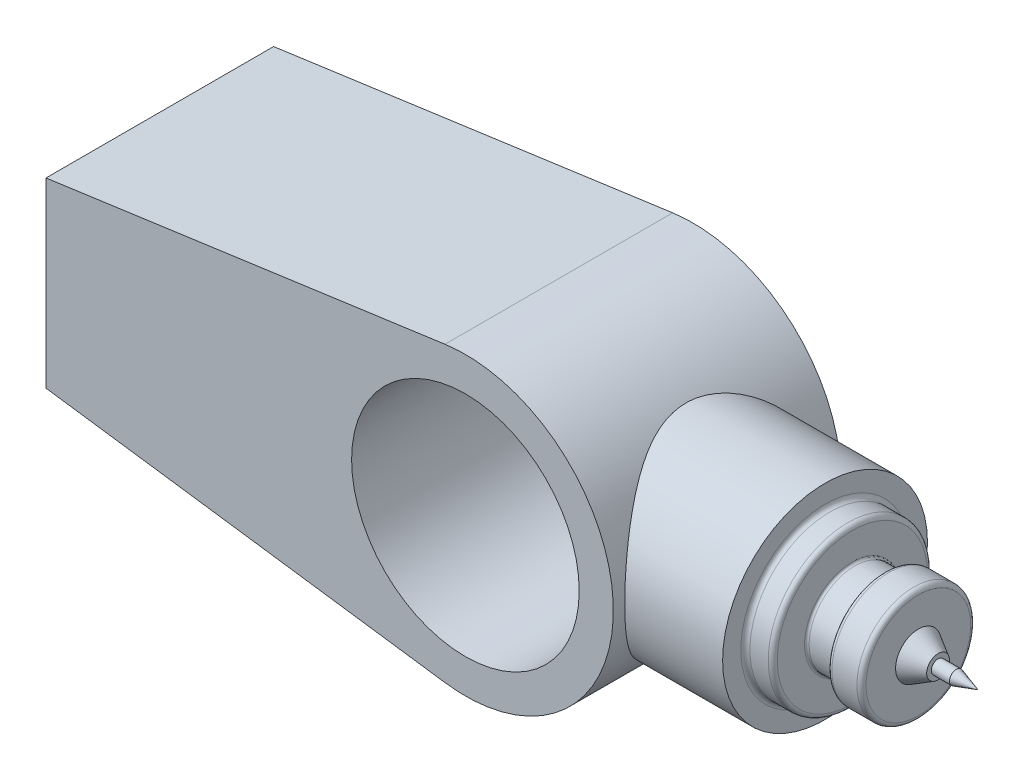
ISO-10303-21;
HEADER;
FILE_DESCRIPTION(('STEP AP214'),'2;1');
FILE_NAME('part.step','',(''),(''),'','','');
FILE_SCHEMA(('AUTOMOTIVE_DESIGN { 1 0 10303 214 1 1 1 1 }'));
ENDSEC;
DATA;
#1=APPLICATION_CONTEXT('core data for automotive mechanical design processes');
#2=APPLICATION_PROTOCOL_DEFINITION('international standard','automotive_design',2000,#1);
#3=PRODUCT_CONTEXT('',#1,'mechanical');
#4=PRODUCT('Part','Part','',(#3));
#5=PRODUCT_RELATED_PRODUCT_CATEGORY('part','',(#4));
#6=PRODUCT_DEFINITION_FORMATION('','',#4);
#7=PRODUCT_DEFINITION_CONTEXT('part definition',#1,'design');
#8=PRODUCT_DEFINITION('design','',#6,#7);
#9=PRODUCT_DEFINITION_SHAPE('','',#8);
#10=(LENGTH_UNIT() NAMED_UNIT(*) SI_UNIT(.MILLI.,.METRE.));
#11=(NAMED_UNIT(*) PLANE_ANGLE_UNIT() SI_UNIT($,.RADIAN.));
#12=(NAMED_UNIT(*) SI_UNIT($,.STERADIAN.) SOLID_ANGLE_UNIT());
#13=UNCERTAINTY_MEASURE_WITH_UNIT(LENGTH_MEASURE(1.E-05),#10,'distance_accuracy_value','');
#14=(GEOMETRIC_REPRESENTATION_CONTEXT(3) GLOBAL_UNCERTAINTY_ASSIGNED_CONTEXT((#13)) GLOBAL_UNIT_ASSIGNED_CONTEXT((#10,
#11,#12)) REPRESENTATION_CONTEXT('',''));
#15=CARTESIAN_POINT('',(0.,0.,0.));
#16=DIRECTION('',(0.,0.,1.));
#17=DIRECTION('',(1.,0.,0.));
#18=AXIS2_PLACEMENT_3D('',#15,#16,#17);
#19=CARTESIAN_POINT('',(120.,0.,0.));
#20=DIRECTION('',(1.,0.,0.));
#21=DIRECTION('',(0.,0.,-1.));
#22=AXIS2_PLACEMENT_3D('',#19,#20,#21);
#23=PLANE('',#22);
#24=CARTESIAN_POINT('',(120.,0.,0.));
#25=DIRECTION('',(1.,0.,0.));
#26=DIRECTION('',(0.,0.,-1.));
#27=AXIS2_PLACEMENT_3D('',#24,#25,#26);
#28=CIRCLE('',#27,21.);
#29=CARTESIAN_POINT('',(120.,0.,-21.));
#30=VERTEX_POINT('',#29);
#31=EDGE_CURVE('E160',#30,#30,#28,.F.);
#32=ORIENTED_EDGE('',*,*,#31,.T.);
#33=EDGE_LOOP('',(#32));
#34=FACE_BOUND('',#33,.T.);
#35=CARTESIAN_POINT('',(120.,0.,0.));
#36=DIRECTION('',(1.,0.,0.));
#37=DIRECTION('',(0.,0.,-1.));
#38=AXIS2_PLACEMENT_3D('',#35,#36,#37);
#39=CIRCLE('',#38,33.);
#40=CARTESIAN_POINT('',(120.,0.,-33.));
#41=VERTEX_POINT('',#40);
#42=EDGE_CURVE('E163',#41,#41,#39,.T.);
#43=ORIENTED_EDGE('',*,*,#42,.T.);
#44=EDGE_LOOP('',(#43));
#45=FACE_BOUND('',#44,.T.);
#46=ADVANCED_FACE('F45',(#34,#45),#23,.T.);
#47=CARTESIAN_POINT('',(0.,0.,0.));
#48=DIRECTION('',(-1.,0.,0.));
#49=DIRECTION('',(0.,0.,1.));
#50=AXIS2_PLACEMENT_3D('',#47,#48,#49);
#51=CYLINDRICAL_SURFACE('',#50,20.);
#52=CARTESIAN_POINT('',(121.,0.,0.));
#53=DIRECTION('',(1.,0.,0.));
#54=DIRECTION('',(0.,0.,-1.));
#55=AXIS2_PLACEMENT_3D('',#52,#53,#54);
#56=CIRCLE('',#55,20.);
#57=CARTESIAN_POINT('',(121.,0.,-20.));
#58=VERTEX_POINT('',#57);
#59=EDGE_CURVE('E55',#58,#58,#56,.T.);
#60=ORIENTED_EDGE('',*,*,#59,.T.);
#61=EDGE_LOOP('',(#60));
#62=FACE_BOUND('',#61,.T.);
#63=CARTESIAN_POINT('',(133.,0.,0.));
#64=DIRECTION('',(-1.,0.,0.));
#65=DIRECTION('',(0.,0.,1.));
#66=AXIS2_PLACEMENT_3D('',#63,#64,#65);
#67=CIRCLE('',#66,20.);
#68=CARTESIAN_POINT('',(133.,0.,20.));
#69=VERTEX_POINT('',#68);
#70=EDGE_CURVE('E190',#69,#69,#67,.T.);
#71=ORIENTED_EDGE('',*,*,#70,.T.);
#72=EDGE_LOOP('',(#71));
#73=FACE_BOUND('',#72,.T.);
#74=ADVANCED_FACE('F148',(#62,#73),#51,.T.);
#75=CARTESIAN_POINT('',(134.,-20.,0.));
#76=DIRECTION('',(-1.,0.,0.));
#77=DIRECTION('',(0.,0.,1.));
#78=AXIS2_PLACEMENT_3D('',#75,#76,#77);
#79=PLANE('',#78);
#80=CARTESIAN_POINT('',(134.,0.,0.));
#81=DIRECTION('',(-1.,0.,0.));
#82=DIRECTION('',(0.,0.,1.));
#83=AXIS2_PLACEMENT_3D('',#80,#81,#82);
#84=CIRCLE('',#83,21.);
#85=CARTESIAN_POINT('',(134.,0.,21.));
#86=VERTEX_POINT('',#85);
#87=EDGE_CURVE('E11',#86,#86,#84,.F.);
#88=ORIENTED_EDGE('',*,*,#87,.T.);
#89=EDGE_LOOP('',(#88));
#90=FACE_BOUND('',#89,.T.);
#91=CARTESIAN_POINT('',(134.,0.,0.));
#92=DIRECTION('',(-1.,0.,0.));
#93=DIRECTION('',(0.,0.,1.));
#94=AXIS2_PLACEMENT_3D('',#91,#92,#93);
#95=CIRCLE('',#94,23.);
#96=CARTESIAN_POINT('',(134.,0.,23.));
#97=VERTEX_POINT('',#96);
#98=EDGE_CURVE('E167',#97,#97,#95,.T.);
#99=ORIENTED_EDGE('',*,*,#98,.T.);
#100=EDGE_LOOP('',(#99));
#101=FACE_BOUND('',#100,.T.);
#102=ADVANCED_FACE('F155',(#90,#101),#79,.T.);
#103=CARTESIAN_POINT('',(0.,0.,0.));
#104=DIRECTION('',(-1.,0.,0.));
#105=DIRECTION('',(0.,0.,1.));
#106=AXIS2_PLACEMENT_3D('',#103,#104,#105);
#107=CYLINDRICAL_SURFACE('',#106,25.);
#108=CARTESIAN_POINT('',(147.,0.,0.));
#109=DIRECTION('',(1.,0.,0.));
#110=DIRECTION('',(0.,0.,-1.));
#111=AXIS2_PLACEMENT_3D('',#108,#109,#110);
#112=CIRCLE('',#111,25.);
#113=CARTESIAN_POINT('',(147.,0.,-25.));
#114=VERTEX_POINT('',#113);
#115=EDGE_CURVE('E293',#114,#114,#112,.F.);
#116=ORIENTED_EDGE('',*,*,#115,.T.);
#117=EDGE_LOOP('',(#116));
#118=FACE_BOUND('',#117,.T.);
#119=CARTESIAN_POINT('',(136.,0.,0.));
#120=DIRECTION('',(-1.,0.,0.));
#121=DIRECTION('',(0.,0.,1.));
#122=AXIS2_PLACEMENT_3D('',#119,#120,#121);
#123=CIRCLE('',#122,25.);
#124=CARTESIAN_POINT('',(136.,0.,25.));
#125=VERTEX_POINT('',#124);
#126=EDGE_CURVE('E289',#125,#125,#123,.F.);
#127=ORIENTED_EDGE('',*,*,#126,.T.);
#128=EDGE_LOOP('',(#127));
#129=FACE_BOUND('',#128,.T.);
#130=ADVANCED_FACE('F305',(#118,#129),#107,.T.);
#131=CARTESIAN_POINT('',(149.,-25.,0.));
#132=DIRECTION('',(1.,0.,0.));
#133=DIRECTION('',(0.,0.,-1.));
#134=AXIS2_PLACEMENT_3D('',#131,#132,#133);
#135=PLANE('',#134);
#136=CARTESIAN_POINT('',(149.,0.,0.));
#137=DIRECTION('',(1.,0.,0.));
#138=DIRECTION('',(0.,0.,-1.));
#139=AXIS2_PLACEMENT_3D('',#136,#137,#138);
#140=CIRCLE('',#139,23.);
#141=CARTESIAN_POINT('',(149.,0.,-23.));
#142=VERTEX_POINT('',#141);
#143=EDGE_CURVE('E177',#142,#142,#140,.T.);
#144=ORIENTED_EDGE('',*,*,#143,.T.);
#145=EDGE_LOOP('',(#144));
#146=FACE_BOUND('',#145,.T.);
#147=CARTESIAN_POINT('',(149.,0.,0.));
#148=DIRECTION('',(-1.,0.,0.));
#149=DIRECTION('',(0.,0.,1.));
#150=AXIS2_PLACEMENT_3D('',#147,#148,#149);
#151=CIRCLE('',#150,10.);
#152=CARTESIAN_POINT('',(149.,0.,10.));
#153=VERTEX_POINT('',#152);
#154=EDGE_CURVE('E126',#153,#153,#151,.T.);
#155=ORIENTED_EDGE('',*,*,#154,.T.);
#156=EDGE_LOOP('',(#155));
#157=FACE_BOUND('',#156,.T.);
#158=ADVANCED_FACE('F300',(#146,#157),#135,.T.);
#159=CARTESIAN_POINT('',(149.,0.,0.));
#160=DIRECTION('',(-1.,0.,0.));
#161=DIRECTION('',(0.,0.,1.));
#162=AXIS2_PLACEMENT_3D('',#159,#160,#161);
#163=CONICAL_SURFACE('',#162,10.,0.523598775598294);
#164=CARTESIAN_POINT('',(157.660254037844,0.,0.));
#165=DIRECTION('',(-1.,0.,0.));
#166=DIRECTION('',(0.,0.,1.));
#167=AXIS2_PLACEMENT_3D('',#164,#165,#166);
#168=CIRCLE('',#167,5.00000000000002);
#169=CARTESIAN_POINT('',(157.660254037844,0.,5.00000000000002));
#170=VERTEX_POINT('',#169);
#171=EDGE_CURVE('E117',#170,#170,#168,.T.);
#172=ORIENTED_EDGE('',*,*,#171,.T.);
#173=EDGE_LOOP('',(#172));
#174=FACE_BOUND('',#173,.T.);
#175=ORIENTED_EDGE('',*,*,#154,.F.);
#176=EDGE_LOOP('',(#175));
#177=FACE_BOUND('',#176,.T.);
#178=ADVANCED_FACE('F320',(#174,#177),#163,.T.);
#179=CARTESIAN_POINT('',(157.660254037844,-5.00000000000002,0.));
#180=DIRECTION('',(1.,0.,0.));
#181=DIRECTION('',(0.,0.,-1.));
#182=AXIS2_PLACEMENT_3D('',#179,#180,#181);
#183=PLANE('',#182);
#184=CARTESIAN_POINT('',(157.660254037844,0.,0.));
#185=DIRECTION('',(-1.,0.,0.));
#186=DIRECTION('',(0.,0.,1.));
#187=AXIS2_PLACEMENT_3D('',#184,#185,#186);
#188=CIRCLE('',#187,3.00000000000002);
#189=CARTESIAN_POINT('',(157.660254037844,0.,3.00000000000002));
#190=VERTEX_POINT('',#189);
#191=EDGE_CURVE('E110',#190,#190,#188,.T.);
#192=ORIENTED_EDGE('',*,*,#191,.T.);
#193=EDGE_LOOP('',(#192));
#194=FACE_BOUND('',#193,.T.);
#195=ORIENTED_EDGE('',*,*,#171,.F.);
#196=EDGE_LOOP('',(#195));
#197=FACE_BOUND('',#196,.T.);
#198=ADVANCED_FACE('F323',(#194,#197),#183,.T.);
#199=CARTESIAN_POINT('',(0.,0.,0.));
#200=DIRECTION('',(-1.,0.,0.));
#201=DIRECTION('',(0.,0.,1.));
#202=AXIS2_PLACEMENT_3D('',#199,#200,#201);
#203=CYLINDRICAL_SURFACE('',#202,3.00000000000002);
#204=CARTESIAN_POINT('',(165.660254037844,0.,0.));
#205=DIRECTION('',(-1.,0.,0.));
#206=DIRECTION('',(0.,0.,1.));
#207=AXIS2_PLACEMENT_3D('',#204,#205,#206);
#208=CIRCLE('',#207,3.00000000000002);
#209=CARTESIAN_POINT('',(165.660254037844,0.,3.00000000000002));
#210=VERTEX_POINT('',#209);
#211=EDGE_CURVE('E107',#210,#210,#208,.T.);
#212=ORIENTED_EDGE('',*,*,#211,.T.);
#213=EDGE_LOOP('',(#212));
#214=FACE_BOUND('',#213,.T.);
#215=ORIENTED_EDGE('',*,*,#191,.F.);
#216=EDGE_LOOP('',(#215));
#217=FACE_BOUND('',#216,.T.);
#218=ADVANCED_FACE('F103',(#214,#217),#203,.T.);
#219=CARTESIAN_POINT('',(165.660254037844,0.,0.));
#220=DIRECTION('',(-1.,0.,0.));
#221=DIRECTION('',(0.,0.,1.));
#222=AXIS2_PLACEMENT_3D('',#219,#220,#221);
#223=CONICAL_SURFACE('',#222,3.00000000000002,0.304692654015402);
#224=CARTESIAN_POINT('',(175.199646052014,0.,0.));
#225=VERTEX_POINT('',#224);
#226=VERTEX_LOOP('',#225);
#227=FACE_BOUND('',#226,.T.);
#228=ORIENTED_EDGE('',*,*,#211,.F.);
#229=EDGE_LOOP('',(#228));
#230=FACE_BOUND('',#229,.T.);
#231=ADVANCED_FACE('F99',(#227,#230),#223,.T.);
#232=CARTESIAN_POINT('',(108.,0.,0.));
#233=DIRECTION('',(1.,0.,0.));
#234=DIRECTION('',(0.,0.,-1.));
#235=AXIS2_PLACEMENT_3D('',#232,#233,#234);
#236=PLANE('',#235);
#237=CARTESIAN_POINT('',(108.,0.,0.));
#238=DIRECTION('',(1.,0.,0.));
#239=DIRECTION('',(0.,0.,-1.));
#240=AXIS2_PLACEMENT_3D('',#237,#238,#239);
#241=CIRCLE('',#240,37.);
#242=CARTESIAN_POINT('',(108.,0.,-37.));
#243=VERTEX_POINT('',#242);
#244=EDGE_CURVE('E184',#243,#243,#241,.F.);
#245=ORIENTED_EDGE('',*,*,#244,.T.);
#246=EDGE_LOOP('',(#245));
#247=FACE_BOUND('',#246,.T.);
#248=CARTESIAN_POINT('',(108.,0.,0.));
#249=DIRECTION('',(1.,0.,0.));
#250=DIRECTION('',(0.,0.,-1.));
#251=AXIS2_PLACEMENT_3D('',#248,#249,#250);
#252=CIRCLE('',#251,45.);
#253=CARTESIAN_POINT('',(108.,0.,-45.));
#254=VERTEX_POINT('',#253);
#255=EDGE_CURVE('E111',#254,#254,#252,.T.);
#256=ORIENTED_EDGE('',*,*,#255,.T.);
#257=EDGE_LOOP('',(#256));
#258=FACE_BOUND('',#257,.T.);
#259=ADVANCED_FACE('F102',(#247,#258),#236,.T.);
#260=CARTESIAN_POINT('',(108.,0.,0.));
#261=DIRECTION('',(1.,0.,0.));
#262=DIRECTION('',(0.,0.,-1.));
#263=AXIS2_PLACEMENT_3D('',#260,#261,#262);
#264=CYLINDRICAL_SURFACE('',#263,35.);
#265=CARTESIAN_POINT('',(118.,0.,0.));
#266=DIRECTION('',(1.,0.,0.));
#267=DIRECTION('',(0.,0.,-1.));
#268=AXIS2_PLACEMENT_3D('',#265,#266,#267);
#269=CIRCLE('',#268,35.);
#270=CARTESIAN_POINT('',(118.,0.,-35.));
#271=VERTEX_POINT('',#270);
#272=EDGE_CURVE('E173',#271,#271,#269,.F.);
#273=ORIENTED_EDGE('',*,*,#272,.T.);
#274=EDGE_LOOP('',(#273));
#275=FACE_BOUND('',#274,.T.);
#276=CARTESIAN_POINT('',(110.,0.,0.));
#277=DIRECTION('',(1.,0.,0.));
#278=DIRECTION('',(0.,0.,-1.));
#279=AXIS2_PLACEMENT_3D('',#276,#277,#278);
#280=CIRCLE('',#279,35.);
#281=CARTESIAN_POINT('',(110.,0.,-35.));
#282=VERTEX_POINT('',#281);
#283=EDGE_CURVE('E166',#282,#282,#280,.T.);
#284=ORIENTED_EDGE('',*,*,#283,.T.);
#285=EDGE_LOOP('',(#284));
#286=FACE_BOUND('',#285,.T.);
#287=ADVANCED_FACE('F245',(#275,#286),#264,.T.);
#288=CARTESIAN_POINT('',(0.,0.,50.));
#289=DIRECTION('',(0.,0.,-1.));
#290=DIRECTION('',(-1.,0.,0.));
#291=AXIS2_PLACEMENT_3D('',#288,#289,#290);
#292=CYLINDRICAL_SURFACE('',#291,50.);
#293=CARTESIAN_POINT('',(0.,0.,50.));
#294=DIRECTION('',(0.,0.,1.));
#295=DIRECTION('',(1.,0.,0.));
#296=AXIS2_PLACEMENT_3D('',#293,#294,#295);
#297=CIRCLE('',#296,50.);
#298=CARTESIAN_POINT('',(50.,0.,50.));
#299=VERTEX_POINT('',#298);
#300=EDGE_CURVE('E140',#299,#299,#297,.T.);
#301=ORIENTED_EDGE('',*,*,#300,.T.);
#302=EDGE_LOOP('',(#301));
#303=FACE_BOUND('',#302,.T.);
#304=CARTESIAN_POINT('',(0.,0.,-50.));
#305=DIRECTION('',(0.,0.,1.));
#306=DIRECTION('',(1.,0.,0.));
#307=AXIS2_PLACEMENT_3D('',#304,#305,#306);
#308=CIRCLE('',#307,50.);
#309=CARTESIAN_POINT('',(50.,0.,-50.));
#310=VERTEX_POINT('',#309);
#311=EDGE_CURVE('E139',#310,#310,#308,.T.);
#312=ORIENTED_EDGE('',*,*,#311,.F.);
#313=EDGE_LOOP('',(#312));
#314=FACE_BOUND('',#313,.T.);
#315=ADVANCED_FACE('F233',(#303,#314),#292,.F.);
#316=CARTESIAN_POINT('',(-184.256419232424,40.,50.));
#317=DIRECTION('',(1.,0.,0.));
#318=DIRECTION('',(0.,1.,0.));
#319=AXIS2_PLACEMENT_3D('',#316,#317,#318);
#320=PLANE('',#319);
#321=DIRECTION('',(0.,-1.,0.));
#322=VECTOR('',#321,1.);
#323=CARTESIAN_POINT('',(-184.256419232424,40.,-50.));
#324=LINE('',#323,#322);
#325=CARTESIAN_POINT('',(-184.256419232424,40.,-50.));
#326=VERTEX_POINT('',#325);
#327=CARTESIAN_POINT('',(-184.256419232423,-40.,-50.));
#328=VERTEX_POINT('',#327);
#329=EDGE_CURVE('E274',#326,#328,#324,.T.);
#330=ORIENTED_EDGE('',*,*,#329,.T.);
#331=DIRECTION('',(0.,0.,-1.));
#332=VECTOR('',#331,1.);
#333=CARTESIAN_POINT('',(-184.256419232423,-40.,50.));
#334=LINE('',#333,#332);
#335=CARTESIAN_POINT('',(-184.256419232423,-40.,50.));
#336=VERTEX_POINT('',#335);
#337=EDGE_CURVE('E283',#336,#328,#334,.T.);
#338=ORIENTED_EDGE('',*,*,#337,.F.);
#339=DIRECTION('',(0.,-1.,0.));
#340=VECTOR('',#339,1.);
#341=CARTESIAN_POINT('',(-184.256419232424,40.,50.));
#342=LINE('',#341,#340);
#343=CARTESIAN_POINT('',(-184.256419232424,40.,50.));
#344=VERTEX_POINT('',#343);
#345=EDGE_CURVE('E95',#344,#336,#342,.T.);
#346=ORIENTED_EDGE('',*,*,#345,.F.);
#347=DIRECTION('',(0.,0.,-1.));
#348=VECTOR('',#347,1.);
#349=CARTESIAN_POINT('',(-184.256419232424,40.,50.));
#350=LINE('',#349,#348);
#351=EDGE_CURVE('E286',#344,#326,#350,.T.);
#352=ORIENTED_EDGE('',*,*,#351,.T.);
#353=EDGE_LOOP('',(#330,#338,#346,#352));
#354=FACE_BOUND('',#353,.T.);
#355=ADVANCED_FACE('F229',(#354),#320,.F.);
#356=CARTESIAN_POINT('',(-184.256419232423,-40.,50.));
#357=DIRECTION('',(0.137749983497304,0.990467032286533,0.));
#358=DIRECTION('',(-0.990467032286533,0.137749983497304,0.));
#359=AXIS2_PLACEMENT_3D('',#356,#357,#358);
#360=PLANE('',#359);
#361=DIRECTION('',(0.990467032286533,-0.137749983497304,0.));
#362=VECTOR('',#361,1.);
#363=CARTESIAN_POINT('',(-184.256419232423,-40.,-50.));
#364=LINE('',#363,#362);
#365=CARTESIAN_POINT('',(-8.95374892732478,-64.3803570986247,-50.));
#366=VERTEX_POINT('',#365);
#367=EDGE_CURVE('E81',#328,#366,#364,.T.);
#368=ORIENTED_EDGE('',*,*,#367,.T.);
#369=DIRECTION('',(0.,0.,-1.));
#370=VECTOR('',#369,1.);
#371=CARTESIAN_POINT('',(-8.95374892732478,-64.3803570986247,50.));
#372=LINE('',#371,#370);
#373=CARTESIAN_POINT('',(-8.95374892732478,-64.3803570986247,50.));
#374=VERTEX_POINT('',#373);
#375=EDGE_CURVE('E281',#374,#366,#372,.T.);
#376=ORIENTED_EDGE('',*,*,#375,.F.);
#377=DIRECTION('',(0.990467032286533,-0.137749983497304,0.));
#378=VECTOR('',#377,1.);
#379=CARTESIAN_POINT('',(-184.256419232423,-40.,50.));
#380=LINE('',#379,#378);
#381=EDGE_CURVE('E265',#336,#374,#380,.T.);
#382=ORIENTED_EDGE('',*,*,#381,.F.);
#383=ORIENTED_EDGE('',*,*,#337,.T.);
#384=EDGE_LOOP('',(#368,#376,#382,#383));
#385=FACE_BOUND('',#384,.T.);
#386=ADVANCED_FACE('F232',(#385),#360,.F.);
#387=CARTESIAN_POINT('',(0.,0.,50.));
#388=DIRECTION('',(0.,0.,1.));
#389=DIRECTION('',(1.,0.,0.));
#390=AXIS2_PLACEMENT_3D('',#387,#388,#389);
#391=PLANE('',#390);
#392=DIRECTION('',(-0.990467032286533,-0.137749983497304,0.));
#393=VECTOR('',#392,1.);
#394=CARTESIAN_POINT('',(-8.95374892732475,64.3803570986246,50.));
#395=LINE('',#394,#393);
#396=CARTESIAN_POINT('',(-8.95374892732479,64.3803570986247,50.));
#397=VERTEX_POINT('',#396);
#398=EDGE_CURVE('E261',#397,#344,#395,.T.);
#399=ORIENTED_EDGE('',*,*,#398,.T.);
#400=ORIENTED_EDGE('',*,*,#345,.T.);
#401=ORIENTED_EDGE('',*,*,#381,.T.);
#402=CARTESIAN_POINT('',(0.,0.,50.));
#403=DIRECTION('',(0.,0.,1.));
#404=DIRECTION('',(1.,0.,0.));
#405=AXIS2_PLACEMENT_3D('',#402,#403,#404);
#406=CIRCLE('',#405,65.);
#407=EDGE_CURVE('E63',#374,#397,#406,.T.);
#408=ORIENTED_EDGE('',*,*,#407,.T.);
#409=EDGE_LOOP('',(#399,#400,#401,#408));
#410=FACE_BOUND('',#409,.T.);
#411=ORIENTED_EDGE('',*,*,#300,.F.);
#412=EDGE_LOOP('',(#411));
#413=FACE_BOUND('',#412,.T.);
#414=ADVANCED_FACE('F227',(#410,#413),#391,.T.);
#415=CARTESIAN_POINT('',(-8.95374892732475,64.3803570986246,50.));
#416=DIRECTION('',(0.137749983497304,-0.990467032286533,0.));
#417=DIRECTION('',(0.990467032286533,0.137749983497304,0.));
#418=AXIS2_PLACEMENT_3D('',#415,#416,#417);
#419=PLANE('',#418);
#420=DIRECTION('',(-0.990467032286533,-0.137749983497304,0.));
#421=VECTOR('',#420,1.);
#422=CARTESIAN_POINT('',(-8.95374892732475,64.3803570986246,-50.));
#423=LINE('',#422,#421);
#424=CARTESIAN_POINT('',(-8.95374892732479,64.3803570986247,-50.));
#425=VERTEX_POINT('',#424);
#426=EDGE_CURVE('E259',#425,#326,#423,.T.);
#427=ORIENTED_EDGE('',*,*,#426,.T.);
#428=ORIENTED_EDGE('',*,*,#351,.F.);
#429=ORIENTED_EDGE('',*,*,#398,.F.);
#430=DIRECTION('',(0.,0.,-1.));
#431=VECTOR('',#430,1.);
#432=CARTESIAN_POINT('',(-8.95374892732479,64.3803570986247,50.));
#433=LINE('',#432,#431);
#434=EDGE_CURVE('E270',#397,#425,#433,.T.);
#435=ORIENTED_EDGE('',*,*,#434,.T.);
#436=EDGE_LOOP('',(#427,#428,#429,#435));
#437=FACE_BOUND('',#436,.T.);
#438=ADVANCED_FACE('F223',(#437),#419,.F.);
#439=CARTESIAN_POINT('',(0.,0.,-50.));
#440=DIRECTION('',(0.,0.,1.));
#441=DIRECTION('',(1.,0.,0.));
#442=AXIS2_PLACEMENT_3D('',#439,#440,#441);
#443=PLANE('',#442);
#444=ORIENTED_EDGE('',*,*,#426,.F.);
#445=CARTESIAN_POINT('',(0.,0.,-50.));
#446=DIRECTION('',(0.,0.,1.));
#447=DIRECTION('',(1.,0.,0.));
#448=AXIS2_PLACEMENT_3D('',#445,#446,#447);
#449=CIRCLE('',#448,65.);
#450=EDGE_CURVE('E87',#366,#425,#449,.T.);
#451=ORIENTED_EDGE('',*,*,#450,.F.);
#452=ORIENTED_EDGE('',*,*,#367,.F.);
#453=ORIENTED_EDGE('',*,*,#329,.F.);
#454=EDGE_LOOP('',(#444,#451,#452,#453));
#455=FACE_BOUND('',#454,.T.);
#456=ORIENTED_EDGE('',*,*,#311,.T.);
#457=EDGE_LOOP('',(#456));
#458=FACE_BOUND('',#457,.T.);
#459=ADVANCED_FACE('F226',(#455,#458),#443,.F.);
#460=CARTESIAN_POINT('',(0.,0.,50.));
#461=DIRECTION('',(0.,0.,-1.));
#462=DIRECTION('',(-1.,0.,0.));
#463=AXIS2_PLACEMENT_3D('',#460,#461,#462);
#464=CYLINDRICAL_SURFACE('',#463,65.);
#465=CARTESIAN_POINT('',(65.,0.,-45.));
#466=CARTESIAN_POINT('',(65.0000011696057,1.12147330120565,-45.0000012025283));
#467=CARTESIAN_POINT('',(64.9709159765212,2.24292945230778,-44.9580201602482));
#468=CARTESIAN_POINT('',(64.8553068641383,4.47658414079082,-44.790785609369));
#469=CARTESIAN_POINT('',(64.7687842573088,5.58878288911931,-44.6655340035371));
#470=CARTESIAN_POINT('',(64.5403785763001,7.79555151848628,-44.3336771879691));
#471=CARTESIAN_POINT('',(64.3984760503456,8.89011506447751,-44.1270433931238));
#472=CARTESIAN_POINT('',(64.0626457436966,11.0533096019768,-43.6354760134034));
#473=CARTESIAN_POINT('',(63.8687169569864,12.1219400915896,-43.3505409144375));
#474=CARTESIAN_POINT('',(63.4342222744662,14.2212125160505,-42.7078017297046));
#475=CARTESIAN_POINT('',(63.1938918545645,15.2520162370063,-42.3503651251477));
#476=CARTESIAN_POINT('',(62.6709259446924,17.2756280115286,-41.5659763086892));
#477=CARTESIAN_POINT('',(62.3882907364915,18.268436318107,-41.1390245597888));
#478=CARTESIAN_POINT('',(61.786108553932,20.2116697228795,-40.2199419970838));
#479=CARTESIAN_POINT('',(61.4665619062631,21.1620951960855,-39.7278117601444));
#480=CARTESIAN_POINT('',(60.7962171584065,23.0172309124314,-38.6825647509799));
#481=CARTESIAN_POINT('',(60.4454175300334,23.9219389167185,-38.1294449962195));
#482=CARTESIAN_POINT('',(59.6865648974474,25.7601880140228,-36.9151737617935));
#483=CARTESIAN_POINT('',(59.27618815402,26.6893215363404,-36.2488040005491));
#484=CARTESIAN_POINT('',(58.4330275057249,28.4880338622967,-34.8529502059224));
#485=CARTESIAN_POINT('',(58.0002425478181,29.3576098626539,-34.1234632053608));
#486=CARTESIAN_POINT('',(57.1195111836477,31.0364486388513,-32.6040251352403));
#487=CARTESIAN_POINT('',(56.6715447181891,31.8456267033451,-31.8139921794123));
#488=CARTESIAN_POINT('',(55.7691986061138,33.4006700551814,-30.1773036556993));
#489=CARTESIAN_POINT('',(55.3148185876119,34.1465316534289,-29.3306447936721));
#490=CARTESIAN_POINT('',(54.3303114345595,35.6959084068904,-27.4326466159468));
#491=CARTESIAN_POINT('',(53.8005937511269,36.4872853280241,-26.3711450656527));
#492=CARTESIAN_POINT('',(52.7593327891933,37.9773509509911,-24.17604025639));
#493=CARTESIAN_POINT('',(52.2477941160227,38.6760162868262,-23.0424189272517));
#494=CARTESIAN_POINT('',(51.2608149265043,39.9749077721744,-20.7072341856928));
#495=CARTESIAN_POINT('',(50.7853275075273,40.5752630453964,-19.5057627267967));
#496=CARTESIAN_POINT('',(49.8892399163793,41.6721166930025,-17.036931864064));
#497=CARTESIAN_POINT('',(49.4686114171658,42.1686687478853,-15.7696069409943));
#498=CARTESIAN_POINT('',(48.8208029416879,42.9149535309565,-13.5723996352816));
#499=CARTESIAN_POINT('',(48.5738420263557,43.1936925213245,-12.6581208440976));
#500=CARTESIAN_POINT('',(48.1238801744123,43.6944569649788,-10.8035389223551));
#501=CARTESIAN_POINT('',(47.9208721021929,43.9164916250901,-9.86324004407419));
#502=CARTESIAN_POINT('',(47.5660754926548,44.3005296261305,-7.96250438663409));
#503=CARTESIAN_POINT('',(47.4142038087044,44.4626304606427,-7.00210302149487));
#504=CARTESIAN_POINT('',(47.1671263845177,44.7246555122386,-5.06554052628518));
#505=CARTESIAN_POINT('',(47.0719206259529,44.824579749433,-4.08937940131224));
#506=CARTESIAN_POINT('',(46.9418899090943,44.9607388198673,-2.1232364847967));
#507=CARTESIAN_POINT('',(46.9073939345417,44.9966266570423,-1.13320851844658));
#508=CARTESIAN_POINT('',(46.9013571135476,45.0029190462422,0.847248377093852));
#509=CARTESIAN_POINT('',(46.9298161498631,44.9733237202183,1.837677305534));
#510=CARTESIAN_POINT('',(47.0484302849821,44.8492190899201,3.81128752429081));
#511=CARTESIAN_POINT('',(47.13862305521,44.7546701492421,4.79446401850661));
#512=CARTESIAN_POINT('',(47.3768313176079,44.5024241630868,6.74551496467455));
#513=CARTESIAN_POINT('',(47.5248480621437,44.3447257499009,7.71338908473168));
#514=CARTESIAN_POINT('',(47.8621764271841,43.9803320764262,9.56919366964684));
#515=CARTESIAN_POINT('',(48.0484149088864,43.7772163066585,10.4583970625519));
#516=CARTESIAN_POINT('',(48.4609441046406,43.32010640119,12.2144143492181));
#517=CARTESIAN_POINT('',(48.6872496045115,43.0660934784815,13.0812198417583));
#518=CARTESIAN_POINT('',(49.1738509640383,42.5096331932465,14.7898225666927));
#519=CARTESIAN_POINT('',(49.4341648638834,42.2071601049958,15.6316062329481));
#520=CARTESIAN_POINT('',(49.9825182796335,41.5563350032134,17.2876417419013));
#521=CARTESIAN_POINT('',(50.2705534011697,41.2079902580444,18.1018979206949));
#522=CARTESIAN_POINT('',(51.0225431471345,40.2767822129268,20.1137766396802));
#523=CARTESIAN_POINT('',(51.5007434523328,39.6654891440572,21.2930273345177));
#524=CARTESIAN_POINT('',(52.4891158781477,38.348029920852,23.5833678403921));
#525=CARTESIAN_POINT('',(52.9993005340589,37.6418264436726,24.6944305853524));
#526=CARTESIAN_POINT('',(54.0361557973494,36.1376496350166,26.8476775780095));
#527=CARTESIAN_POINT('',(54.5628535785461,35.3395185623559,27.8897384505711));
#528=CARTESIAN_POINT('',(55.6171804467178,33.6558443419671,29.8998791095632));
#529=CARTESIAN_POINT('',(56.1448094104418,32.7703120184234,30.8679680307498));
#530=CARTESIAN_POINT('',(57.1932449701135,30.9045304086319,32.7363921475659));
#531=CARTESIAN_POINT('',(57.7139191350983,29.9233731295192,33.6358963165067));
#532=CARTESIAN_POINT('',(58.7296419536465,27.8771206485979,35.350355349792));
#533=CARTESIAN_POINT('',(59.2246882700661,26.8120178135979,36.1653025097018));
#534=CARTESIAN_POINT('',(60.1756566955639,24.6035209522421,37.7024332048813));
#535=CARTESIAN_POINT('',(60.6316475651595,23.4602711709794,38.4247809320632));
#536=CARTESIAN_POINT('',(61.4931891608211,21.0989507187335,39.7703323765769));
#537=CARTESIAN_POINT('',(61.898755017873,19.8809026570889,40.3935658507715));
#538=CARTESIAN_POINT('',(62.5646802947783,17.6549035875762,41.4059204565395));
#539=CARTESIAN_POINT('',(62.8372982548467,16.6602403417733,41.8163120535009));
#540=CARTESIAN_POINT('',(63.3397164077328,14.6345031625144,42.5675669112335));
#541=CARTESIAN_POINT('',(63.569522535998,13.603434299959,42.9084398107234));
#542=CARTESIAN_POINT('',(63.9815049902596,11.5110112910016,43.5164676119118));
#543=CARTESIAN_POINT('',(64.1637052650743,10.4496726714621,43.7836595836378));
#544=CARTESIAN_POINT('',(64.476639865795,8.30296993183371,44.2409869387356));
#545=CARTESIAN_POINT('',(64.6073730982257,7.21760530180254,44.431120684921));
#546=CARTESIAN_POINT('',(64.8147345736682,5.02649787175023,44.7321113931983));
#547=CARTESIAN_POINT('',(64.8911534961694,3.92069290489763,44.8426616714377));
#548=CARTESIAN_POINT('',(64.9872183357685,1.70145350776208,44.981563734156));
#549=CARTESIAN_POINT('',(65.0068642771874,0.588019080747696,45.0099155538474));
#550=CARTESIAN_POINT('',(64.9889001241945,-1.63741781931566,44.9839662509349));
#551=CARTESIAN_POINT('',(64.9512898349751,-2.74942028747967,44.929664847113));
#552=CARTESIAN_POINT('',(64.819734418053,-4.96298947367603,44.7392747901952));
#553=CARTESIAN_POINT('',(64.7257910494465,-6.06455651648127,44.6031886909653));
#554=CARTESIAN_POINT('',(64.491175703309,-8.18254449212149,44.2620157992034));
#555=CARTESIAN_POINT('',(64.3536808680178,-9.20007959997774,44.0616107864454));
#556=CARTESIAN_POINT('',(64.0337856060908,-11.2121337136589,43.5930613516679));
#557=CARTESIAN_POINT('',(63.8513873855499,-12.2066538475799,43.3249202574929));
#558=CARTESIAN_POINT('',(63.4451725249075,-14.1673074608523,42.7239854011605));
#559=CARTESIAN_POINT('',(63.2213525684632,-15.1334386601223,42.3911864622047));
#560=CARTESIAN_POINT('',(62.736336352677,-17.0327019487273,41.6643868113868));
#561=CARTESIAN_POINT('',(62.4751380044848,-17.965832190203,41.2703826790343));
#562=CARTESIAN_POINT('',(61.8990085085122,-19.8637431772395,40.3931275129008));
#563=CARTESIAN_POINT('',(61.5815209528501,-20.8256806929253,39.9054081529014));
#564=CARTESIAN_POINT('',(60.9142086391395,-22.7035764997345,38.8677076181211));
#565=CARTESIAN_POINT('',(60.5643826081083,-23.6195329786528,38.3177239921568));
#566=CARTESIAN_POINT('',(59.8381347129401,-25.4032558353403,37.1592008079418));
#567=CARTESIAN_POINT('',(59.4616987975441,-26.270996314329,36.5506302507532));
#568=CARTESIAN_POINT('',(58.6884577670336,-27.9557544991496,35.2787474176625));
#569=CARTESIAN_POINT('',(58.2916515549571,-28.7727694681138,34.6154321925309));
#570=CARTESIAN_POINT('',(57.4151711853793,-30.4889708749912,33.1199200847161));
#571=CARTESIAN_POINT('',(56.9328754552547,-31.3785212006928,32.2781812569548));
#572=CARTESIAN_POINT('',(55.9590893109094,-33.0839042215169,30.5278352445589));
#573=CARTESIAN_POINT('',(55.4675975421249,-33.8997259516808,29.6192181500899));
#574=CARTESIAN_POINT('',(54.4860350387397,-35.45586994741,27.7375714933993));
#575=CARTESIAN_POINT('',(53.9959654596117,-36.1961418986443,26.7644997080007));
#576=CARTESIAN_POINT('',(53.0294834997435,-37.5978502361011,24.7568233036382));
#577=CARTESIAN_POINT('',(52.553069328415,-38.2592969946585,23.7222268074148));
#578=CARTESIAN_POINT('',(51.679941347726,-39.4291013564639,21.7149007388747));
#579=CARTESIAN_POINT('',(51.2803372484816,-39.9463152685162,20.7485884228094));
#580=CARTESIAN_POINT('',(50.5123974548912,-40.9130636661729,18.7705314851885));
#581=CARTESIAN_POINT('',(50.1440619804653,-41.3625976757848,17.7587865441704));
#582=CARTESIAN_POINT('',(49.4504928922364,-42.1893301292689,15.693797265063));
#583=CARTESIAN_POINT('',(49.1251906412473,-42.566644202947,14.6406225749502));
#584=CARTESIAN_POINT('',(48.5290098021012,-43.2451098617227,12.4950157035289));
#585=CARTESIAN_POINT('',(48.2581179989952,-43.5462799449171,11.4025931307277));
#586=CARTESIAN_POINT('',(47.8271610412375,-44.0186874861181,9.3921629994351));
#587=CARTESIAN_POINT('',(47.6558419905218,-44.2036946073207,8.47979353570419));
#588=CARTESIAN_POINT('',(47.3627606953031,-44.517583244497,6.63757582668245));
#589=CARTESIAN_POINT('',(47.2409923142224,-44.6464717105955,5.70772976070373));
#590=CARTESIAN_POINT('',(47.05166615705,-44.8459556683364,3.83718735816971));
#591=CARTESIAN_POINT('',(46.9840561376509,-44.9166073394187,2.89650236820514));
#592=CARTESIAN_POINT('',(46.9055698265682,-44.9985645522097,1.01014116515035));
#593=CARTESIAN_POINT('',(46.894694331428,-45.0098692606967,0.0644648821697862));
#594=CARTESIAN_POINT('',(46.9301408777119,-44.972908524549,-1.82506201386804));
#595=CARTESIAN_POINT('',(46.9764888551696,-44.9246160680299,-2.76891160474201));
#596=CARTESIAN_POINT('',(47.1245232303033,-44.7693052695385,-4.64731891289862));
#597=CARTESIAN_POINT('',(47.226209296244,-44.6622872796082,-5.58187668584874));
#598=CARTESIAN_POINT('',(47.4811423262629,-44.3911660407895,-7.43666598606561));
#599=CARTESIAN_POINT('',(47.634452919394,-44.2269923369625,-8.35687836049678));
#600=CARTESIAN_POINT('',(47.9871889035597,-43.8440109221367,-10.1768310643423));
#601=CARTESIAN_POINT('',(48.1866204648689,-43.6251959006593,-11.0765686368372));
#602=CARTESIAN_POINT('',(48.6908782922366,-43.0625185245671,-13.116726178063));
#603=CARTESIAN_POINT('',(49.0093972350599,-42.7008255731353,-14.2488681052183));
#604=CARTESIAN_POINT('',(49.699554494161,-41.8955268796886,-16.4668795226373));
#605=CARTESIAN_POINT('',(50.0712093704162,-41.4518955887103,-17.5527344499461));
#606=CARTESIAN_POINT('',(50.8544123719762,-40.4872212981013,-19.6760329984318));
#607=CARTESIAN_POINT('',(51.2660067549033,-39.9660881554129,-20.7134183727638));
#608=CARTESIAN_POINT('',(52.116211879306,-38.8508952329155,-22.7363587217865));
#609=CARTESIAN_POINT('',(52.5548209260535,-38.2568400254561,-23.7219169406072));
#610=CARTESIAN_POINT('',(53.4579357785502,-36.9847423381263,-25.6613286822633));
#611=CARTESIAN_POINT('',(53.9228021101371,-36.3051118639051,-26.6139712103077));
#612=CARTESIAN_POINT('',(54.8583333343946,-34.8753950985048,-28.4617532840731));
#613=CARTESIAN_POINT('',(55.3289982185488,-34.1253089107936,-29.3568929142368));
#614=CARTESIAN_POINT('',(56.2664339133503,-32.5564691651912,-31.0876310121466));
#615=CARTESIAN_POINT('',(56.7332035093429,-31.7376950080829,-31.923211478402));
#616=CARTESIAN_POINT('',(57.6535165855435,-30.033481652025,-33.5315189390535));
#617=CARTESIAN_POINT('',(58.1070588196762,-29.1480362003111,-34.3042400240121));
#618=CARTESIAN_POINT('',(59.0635284336244,-27.1643113596245,-35.9022819462667));
#619=CARTESIAN_POINT('',(59.5626106290919,-26.0547472869609,-36.7159606163356));
#620=CARTESIAN_POINT('',(60.5176757229357,-23.7521280348398,-38.2458641369291));
#621=CARTESIAN_POINT('',(60.9736519283074,-22.5590599397198,-38.962073861155));
#622=CARTESIAN_POINT('',(61.6149926579414,-20.7127348127311,-39.9558623322098));
#623=CARTESIAN_POINT('',(61.8215919655179,-20.088110583999,-40.2735888165198));
#624=CARTESIAN_POINT('',(62.2191547005856,-18.8206694867556,-40.8812436548858));
#625=CARTESIAN_POINT('',(62.4101203779565,-18.1778552539997,-41.1711760099034));
#626=CARTESIAN_POINT('',(62.7748527233683,-16.875283117665,-41.7219931318356));
#627=CARTESIAN_POINT('',(62.9486230408552,-16.2155288469421,-41.9828840638124));
#628=CARTESIAN_POINT('',(63.2775356475737,-14.8804011558233,-42.4744610119283));
#629=CARTESIAN_POINT('',(63.432679284421,-14.2050288695917,-42.7051492133046));
#630=CARTESIAN_POINT('',(63.8070721968101,-12.4447010544915,-43.25974494481));
#631=CARTESIAN_POINT('',(64.0114184468014,-11.3490405228654,-43.5602757498286));
#632=CARTESIAN_POINT('',(64.3654191982087,-9.12991345978806,-44.078827644396));
#633=CARTESIAN_POINT('',(64.5150820049425,-8.00645117856259,-44.2968612637911));
#634=CARTESIAN_POINT('',(64.7559993187061,-5.74082253729113,-44.6470112993716));
#635=CARTESIAN_POINT('',(64.847297757104,-4.59867091062173,-44.7791923387443));
#636=CARTESIAN_POINT('',(64.9692976296881,-2.30434018473195,-44.9556862638234));
#637=CARTESIAN_POINT('',(64.9999987983895,-1.15216104160189,-44.999998764566));
#638=CARTESIAN_POINT('',(65.,0.,-45.));
#639=B_SPLINE_CURVE_WITH_KNOTS('',3,(#465,#466,#467,#468,#469,#470,#471,#472,#473,#474,#475,
#476,#477,#478,#479,#480,#481,#482,#483,#484,#485,#486,#487,#488,#489,#490,#491,#492,#493,#494,
#495,#496,#497,#498,#499,#500,#501,#502,#503,#504,#505,#506,#507,#508,#509,#510,#511,#512,#513,
#514,#515,#516,#517,#518,#519,#520,#521,#522,#523,#524,#525,#526,#527,#528,#529,#530,#531,#532,
#533,#534,#535,#536,#537,#538,#539,#540,#541,#542,#543,#544,#545,#546,#547,#548,#549,#550,#551,
#552,#553,#554,#555,#556,#557,#558,#559,#560,#561,#562,#563,#564,#565,#566,#567,#568,#569,#570,
#571,#572,#573,#574,#575,#576,#577,#578,#579,#580,#581,#582,#583,#584,#585,#586,#587,#588,#589,
#590,#591,#592,#593,#594,#595,#596,#597,#598,#599,#600,#601,#602,#603,#604,#605,#606,#607,#608,
#609,#610,#611,#612,#613,#614,#615,#616,#617,#618,#619,#620,#621,#622,#623,#624,#625,#626,#627,
#628,#629,#630,#631,#632,#633,#634,#635,#636,#637,#638),.UNSPECIFIED.,.T.,.F.,(4,2,2,2,2,2,2,2,
2,2,2,2,2,2,2,2,2,2,2,2,2,2,2,2,2,2,2,2,2,2,2,2,2,2,2,2,2,2,2,2,2,2,2,2,2,2,2,2,2,2,2,2,2,2,2,2,
2,2,2,2,2,2,2,2,2,2,2,2,2,2,2,2,2,2,2,2,2,2,2,2,2,2,2,2,2,2,4),(0.,3.36323892794144,
6.72640100710137,10.0907454360665,13.4551549250109,16.8029195613731,20.1506619010729,
23.4983746134034,26.8462511096753,30.4871649037346,34.1282499524345,37.7743494260164,
41.4206611917409,45.6939383064405,49.9682903731881,54.2369825353392,58.5034617073671,
61.4625138492405,64.4210852373372,67.3748225577202,70.3285589227263,73.2982527376573,
76.2679410220407,79.2394430998938,82.2110095388412,85.0011411726389,87.7923045951578,
90.584954683776,93.3771628083065,97.6064034875675,101.837312178738,106.075592113262,
110.313347816192,114.596218662803,118.879479402292,123.155037051935,127.429308626693,
130.755998382163,134.082226580387,137.406778235214,140.731400520075,144.068767009318,
147.406132068879,150.743508483461,154.080780688207,157.215791533369,160.350648386749,
163.485756334407,166.621039552604,169.990545063149,173.360183268584,176.73161428665,
180.103227050672,184.047902440152,187.993163521895,191.94103513809,195.888386692538,
199.385185586645,202.88200907258,206.373186157811,209.863514294626,212.700365177753,
215.536864625513,218.370624567028,221.204424293963,224.039508887241,226.874576485218,
229.713151272815,232.55210603787,236.23803941247,239.925124033801,243.616531168718,
247.307706963636,251.081871120678,254.856029735252,258.631324277359,262.406973327354,
266.792058434818,271.177823293658,273.368885604935,275.55963203795,277.749912517597,
279.940034437727,283.398420446896,286.856280978073,290.31153567335,293.766805506531),.UNSPECIFIED.);
#640=CARTESIAN_POINT('',(65.,0.,-45.));
#641=VERTEX_POINT('',#640);
#642=EDGE_CURVE('E130',#641,#641,#639,.T.);
#643=ORIENTED_EDGE('',*,*,#642,.F.);
#644=EDGE_LOOP('',(#643));
#645=FACE_BOUND('',#644,.T.);
#646=ORIENTED_EDGE('',*,*,#450,.T.);
#647=ORIENTED_EDGE('',*,*,#434,.F.);
#648=ORIENTED_EDGE('',*,*,#407,.F.);
#649=ORIENTED_EDGE('',*,*,#375,.T.);
#650=EDGE_LOOP('',(#646,#647,#648,#649));
#651=FACE_BOUND('',#650,.T.);
#652=ADVANCED_FACE('F236',(#645,#651),#464,.T.);
#653=CARTESIAN_POINT('',(-184.258419232424,0.,0.));
#654=DIRECTION('',(1.,0.,0.));
#655=DIRECTION('',(0.,0.,-1.));
#656=AXIS2_PLACEMENT_3D('',#653,#654,#655);
#657=CYLINDRICAL_SURFACE('',#656,45.);
#658=ORIENTED_EDGE('',*,*,#642,.T.);
#659=EDGE_LOOP('',(#658));
#660=FACE_BOUND('',#659,.T.);
#661=ORIENTED_EDGE('',*,*,#255,.F.);
#662=EDGE_LOOP('',(#661));
#663=FACE_BOUND('',#662,.T.);
#664=ADVANCED_FACE('F142',(#660,#663),#657,.T.);
#665=CARTESIAN_POINT('',(147.,0.,0.));
#666=DIRECTION('',(1.,0.,0.));
#667=DIRECTION('',(0.,0.,-1.));
#668=AXIS2_PLACEMENT_3D('',#665,#666,#667);
#669=TOROIDAL_SURFACE('',#668,23.,2.);
#670=ORIENTED_EDGE('',*,*,#143,.F.);
#671=EDGE_LOOP('',(#670));
#672=FACE_BOUND('',#671,.T.);
#673=ORIENTED_EDGE('',*,*,#115,.F.);
#674=EDGE_LOOP('',(#673));
#675=FACE_BOUND('',#674,.T.);
#676=ADVANCED_FACE('F218',(#672,#675),#669,.T.);
#677=CARTESIAN_POINT('',(136.,0.,0.));
#678=DIRECTION('',(-1.,0.,0.));
#679=DIRECTION('',(0.,0.,1.));
#680=AXIS2_PLACEMENT_3D('',#677,#678,#679);
#681=TOROIDAL_SURFACE('',#680,23.,2.);
#682=ORIENTED_EDGE('',*,*,#126,.F.);
#683=EDGE_LOOP('',(#682));
#684=FACE_BOUND('',#683,.T.);
#685=ORIENTED_EDGE('',*,*,#98,.F.);
#686=EDGE_LOOP('',(#685));
#687=FACE_BOUND('',#686,.T.);
#688=ADVANCED_FACE('F214',(#684,#687),#681,.T.);
#689=CARTESIAN_POINT('',(118.,0.,0.));
#690=DIRECTION('',(1.,0.,0.));
#691=DIRECTION('',(0.,0.,-1.));
#692=AXIS2_PLACEMENT_3D('',#689,#690,#691);
#693=TOROIDAL_SURFACE('',#692,33.,2.);
#694=ORIENTED_EDGE('',*,*,#272,.F.);
#695=EDGE_LOOP('',(#694));
#696=FACE_BOUND('',#695,.T.);
#697=ORIENTED_EDGE('',*,*,#42,.F.);
#698=EDGE_LOOP('',(#697));
#699=FACE_BOUND('',#698,.T.);
#700=ADVANCED_FACE('F208',(#696,#699),#693,.T.);
#701=CARTESIAN_POINT('',(110.,0.,0.));
#702=DIRECTION('',(1.,0.,0.));
#703=DIRECTION('',(0.,0.,-1.));
#704=AXIS2_PLACEMENT_3D('',#701,#702,#703);
#705=TOROIDAL_SURFACE('',#704,37.,2.);
#706=ORIENTED_EDGE('',*,*,#244,.F.);
#707=EDGE_LOOP('',(#706));
#708=FACE_BOUND('',#707,.T.);
#709=ORIENTED_EDGE('',*,*,#283,.F.);
#710=EDGE_LOOP('',(#709));
#711=FACE_BOUND('',#710,.T.);
#712=ADVANCED_FACE('F202',(#708,#711),#705,.F.);
#713=CARTESIAN_POINT('',(121.,0.,0.));
#714=DIRECTION('',(1.,0.,0.));
#715=DIRECTION('',(0.,0.,-1.));
#716=AXIS2_PLACEMENT_3D('',#713,#714,#715);
#717=TOROIDAL_SURFACE('',#716,21.,1.);
#718=ORIENTED_EDGE('',*,*,#59,.F.);
#719=EDGE_LOOP('',(#718));
#720=FACE_BOUND('',#719,.T.);
#721=ORIENTED_EDGE('',*,*,#31,.F.);
#722=EDGE_LOOP('',(#721));
#723=FACE_BOUND('',#722,.T.);
#724=ADVANCED_FACE('F199',(#720,#723),#717,.F.);
#725=CARTESIAN_POINT('',(133.,0.,0.));
#726=DIRECTION('',(-1.,0.,0.));
#727=DIRECTION('',(0.,0.,1.));
#728=AXIS2_PLACEMENT_3D('',#725,#726,#727);
#729=TOROIDAL_SURFACE('',#728,21.,1.);
#730=ORIENTED_EDGE('',*,*,#87,.F.);
#731=EDGE_LOOP('',(#730));
#732=FACE_BOUND('',#731,.T.);
#733=ORIENTED_EDGE('',*,*,#70,.F.);
#734=EDGE_LOOP('',(#733));
#735=FACE_BOUND('',#734,.T.);
#736=ADVANCED_FACE('F47',(#732,#735),#729,.F.);
#737=CLOSED_SHELL('',(#46,#74,#102,#130,#158,#178,#198,#218,#231,#259,#287,#315,#355,#386,#414,
#438,#459,#652,#664,#676,#688,#700,#712,#724,#736));
#738=MANIFOLD_SOLID_BREP('B2',#737);
#739=ADVANCED_BREP_SHAPE_REPRESENTATION('',(#18,#738),#14);
#740=SHAPE_DEFINITION_REPRESENTATION(#9,#739);
ENDSEC;
END-ISO-10303-21;
